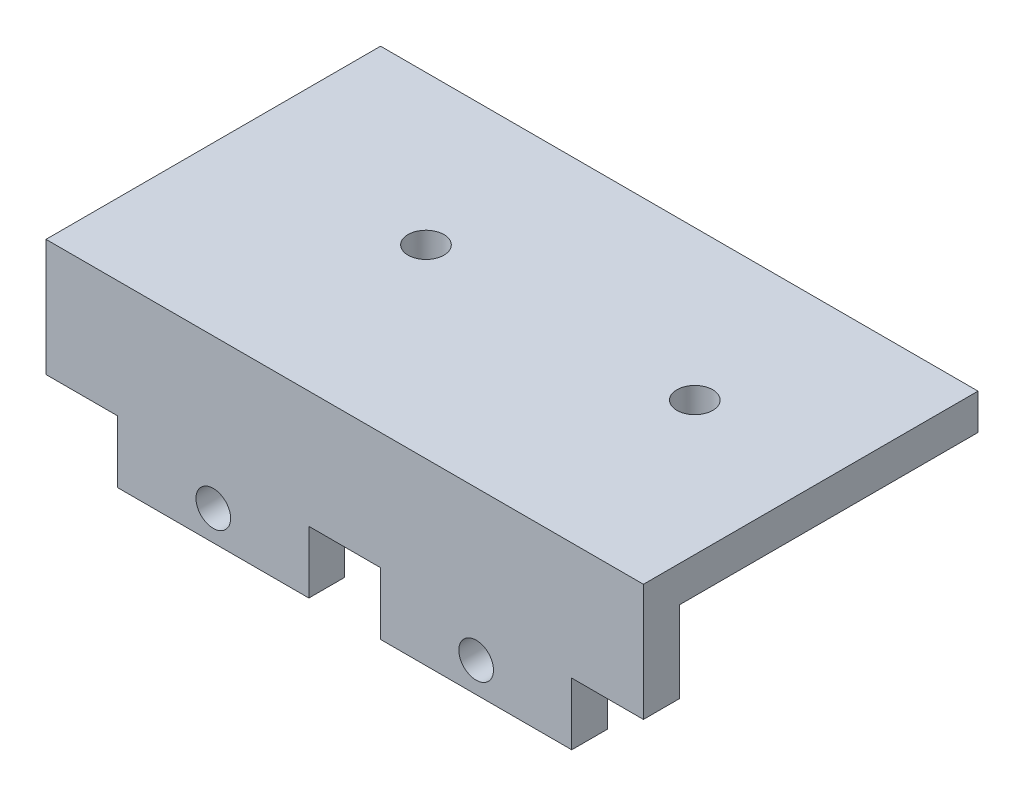
ISO-10303-21;
HEADER;
FILE_DESCRIPTION(('STEP AP214'),'2;1');
FILE_NAME('part.step','',(''),(''),'','','');
FILE_SCHEMA(('AUTOMOTIVE_DESIGN { 1 0 10303 214 1 1 1 1 }'));
ENDSEC;
DATA;
#1=APPLICATION_CONTEXT('core data for automotive mechanical design processes');
#2=APPLICATION_PROTOCOL_DEFINITION('international standard','automotive_design',2000,#1);
#3=PRODUCT_CONTEXT('',#1,'mechanical');
#4=PRODUCT('Part','Part','',(#3));
#5=PRODUCT_RELATED_PRODUCT_CATEGORY('part','',(#4));
#6=PRODUCT_DEFINITION_FORMATION('','',#4);
#7=PRODUCT_DEFINITION_CONTEXT('part definition',#1,'design');
#8=PRODUCT_DEFINITION('design','',#6,#7);
#9=PRODUCT_DEFINITION_SHAPE('','',#8);
#10=(LENGTH_UNIT() NAMED_UNIT(*) SI_UNIT(.MILLI.,.METRE.));
#11=(NAMED_UNIT(*) PLANE_ANGLE_UNIT() SI_UNIT($,.RADIAN.));
#12=(NAMED_UNIT(*) SI_UNIT($,.STERADIAN.) SOLID_ANGLE_UNIT());
#13=UNCERTAINTY_MEASURE_WITH_UNIT(LENGTH_MEASURE(1.E-05),#10,'distance_accuracy_value','');
#14=(GEOMETRIC_REPRESENTATION_CONTEXT(3) GLOBAL_UNCERTAINTY_ASSIGNED_CONTEXT((#13)) GLOBAL_UNIT_ASSIGNED_CONTEXT((#10,
#11,#12)) REPRESENTATION_CONTEXT('',''));
#15=CARTESIAN_POINT('',(0.,0.,0.));
#16=DIRECTION('',(0.,0.,1.));
#17=DIRECTION('',(1.,0.,0.));
#18=AXIS2_PLACEMENT_3D('',#15,#16,#17);
#19=CARTESIAN_POINT('',(0.,-2.5,0.));
#20=DIRECTION('',(0.,1.,0.));
#21=DIRECTION('',(0.,0.,1.));
#22=AXIS2_PLACEMENT_3D('',#19,#20,#21);
#23=PLANE('',#22);
#24=DIRECTION('',(1.,0.,0.));
#25=VECTOR('',#24,1.);
#26=CARTESIAN_POINT('',(-25.,-2.5,15.5));
#27=LINE('',#26,#25);
#28=CARTESIAN_POINT('',(-19.,-2.5,15.5));
#29=VERTEX_POINT('',#28);
#30=CARTESIAN_POINT('',(-3.,-2.5,15.5));
#31=VERTEX_POINT('',#30);
#32=EDGE_CURVE('E220',#29,#31,#27,.T.);
#33=ORIENTED_EDGE('',*,*,#32,.F.);
#34=DIRECTION('',(0.,0.,1.));
#35=VECTOR('',#34,1.);
#36=CARTESIAN_POINT('',(-19.,-2.5,-12.5));
#37=LINE('',#36,#35);
#38=CARTESIAN_POINT('',(-19.,-2.5,12.5));
#39=VERTEX_POINT('',#38);
#40=EDGE_CURVE('E245',#39,#29,#37,.T.);
#41=ORIENTED_EDGE('',*,*,#40,.F.);
#42=DIRECTION('',(-1.,0.,0.));
#43=VECTOR('',#42,1.);
#44=CARTESIAN_POINT('',(49.95,-2.5,12.5));
#45=LINE('',#44,#43);
#46=CARTESIAN_POINT('',(-3.,-2.5,12.5));
#47=VERTEX_POINT('',#46);
#48=EDGE_CURVE('E188',#47,#39,#45,.T.);
#49=ORIENTED_EDGE('',*,*,#48,.F.);
#50=DIRECTION('',(0.,0.,1.));
#51=VECTOR('',#50,1.);
#52=CARTESIAN_POINT('',(-3.,-2.5,-12.5));
#53=LINE('',#52,#51);
#54=EDGE_CURVE('E253',#47,#31,#53,.T.);
#55=ORIENTED_EDGE('',*,*,#54,.T.);
#56=EDGE_LOOP('',(#33,#41,#49,#55));
#57=FACE_BOUND('',#56,.T.);
#58=ADVANCED_FACE('F38',(#57),#23,.F.);
#59=CARTESIAN_POINT('',(0.,0.,15.5));
#60=DIRECTION('',(0.,0.,-1.));
#61=DIRECTION('',(-1.,0.,0.));
#62=AXIS2_PLACEMENT_3D('',#59,#60,#61);
#63=PLANE('',#62);
#64=CARTESIAN_POINT('',(-11.,0.,15.5));
#65=DIRECTION('',(0.,0.,-1.));
#66=DIRECTION('',(-1.,0.,0.));
#67=AXIS2_PLACEMENT_3D('',#64,#65,#66);
#68=CIRCLE('',#67,1.45);
#69=CARTESIAN_POINT('',(-12.45,0.,15.5));
#70=VERTEX_POINT('',#69);
#71=EDGE_CURVE('E168',#70,#70,#68,.T.);
#72=ORIENTED_EDGE('',*,*,#71,.T.);
#73=EDGE_LOOP('',(#72));
#74=FACE_BOUND('',#73,.T.);
#75=CARTESIAN_POINT('',(11.,0.,15.5));
#76=DIRECTION('',(0.,0.,-1.));
#77=DIRECTION('',(-1.,0.,0.));
#78=AXIS2_PLACEMENT_3D('',#75,#76,#77);
#79=CIRCLE('',#78,1.45);
#80=CARTESIAN_POINT('',(9.55,0.,15.5));
#81=VERTEX_POINT('',#80);
#82=EDGE_CURVE('E149',#81,#81,#79,.T.);
#83=ORIENTED_EDGE('',*,*,#82,.T.);
#84=EDGE_LOOP('',(#83));
#85=FACE_BOUND('',#84,.T.);
#86=DIRECTION('',(0.,-1.,0.));
#87=VECTOR('',#86,1.);
#88=CARTESIAN_POINT('',(-25.,-2.5,15.5));
#89=LINE('',#88,#87);
#90=CARTESIAN_POINT('',(-25.,12.5,15.5));
#91=VERTEX_POINT('',#90);
#92=CARTESIAN_POINT('',(-25.,2.7,15.5));
#93=VERTEX_POINT('',#92);
#94=EDGE_CURVE('E216',#91,#93,#89,.T.);
#95=ORIENTED_EDGE('',*,*,#94,.T.);
#96=DIRECTION('',(1.,0.,0.));
#97=VECTOR('',#96,1.);
#98=CARTESIAN_POINT('',(0.,2.7,15.5));
#99=LINE('',#98,#97);
#100=CARTESIAN_POINT('',(-19.,2.7,15.5));
#101=VERTEX_POINT('',#100);
#102=EDGE_CURVE('E185',#93,#101,#99,.T.);
#103=ORIENTED_EDGE('',*,*,#102,.T.);
#104=DIRECTION('',(0.,-1.,0.));
#105=VECTOR('',#104,1.);
#106=CARTESIAN_POINT('',(-19.,0.,15.5));
#107=LINE('',#106,#105);
#108=EDGE_CURVE('E182',#101,#29,#107,.T.);
#109=ORIENTED_EDGE('',*,*,#108,.T.);
#110=ORIENTED_EDGE('',*,*,#32,.T.);
#111=DIRECTION('',(0.,1.,0.));
#112=VECTOR('',#111,1.);
#113=CARTESIAN_POINT('',(-3.,0.,15.5));
#114=LINE('',#113,#112);
#115=CARTESIAN_POINT('',(-3.,2.7,15.5));
#116=VERTEX_POINT('',#115);
#117=EDGE_CURVE('E179',#31,#116,#114,.T.);
#118=ORIENTED_EDGE('',*,*,#117,.T.);
#119=DIRECTION('',(1.,0.,0.));
#120=VECTOR('',#119,1.);
#121=CARTESIAN_POINT('',(0.,2.7,15.5));
#122=LINE('',#121,#120);
#123=CARTESIAN_POINT('',(3.,2.7,15.5));
#124=VERTEX_POINT('',#123);
#125=EDGE_CURVE('E176',#116,#124,#122,.T.);
#126=ORIENTED_EDGE('',*,*,#125,.T.);
#127=DIRECTION('',(0.,-1.,0.));
#128=VECTOR('',#127,1.);
#129=CARTESIAN_POINT('',(3.,0.,15.5));
#130=LINE('',#129,#128);
#131=CARTESIAN_POINT('',(3.,-2.5,15.5));
#132=VERTEX_POINT('',#131);
#133=EDGE_CURVE('E174',#124,#132,#130,.T.);
#134=ORIENTED_EDGE('',*,*,#133,.T.);
#135=CARTESIAN_POINT('',(19.,-2.5,15.5));
#136=VERTEX_POINT('',#135);
#137=EDGE_CURVE('E164',#132,#136,#27,.T.);
#138=ORIENTED_EDGE('',*,*,#137,.T.);
#139=DIRECTION('',(0.,1.,0.));
#140=VECTOR('',#139,1.);
#141=CARTESIAN_POINT('',(19.,0.,15.5));
#142=LINE('',#141,#140);
#143=CARTESIAN_POINT('',(19.,2.7,15.5));
#144=VERTEX_POINT('',#143);
#145=EDGE_CURVE('E148',#136,#144,#142,.T.);
#146=ORIENTED_EDGE('',*,*,#145,.T.);
#147=DIRECTION('',(1.,0.,0.));
#148=VECTOR('',#147,1.);
#149=CARTESIAN_POINT('',(0.,2.7,15.5));
#150=LINE('',#149,#148);
#151=CARTESIAN_POINT('',(25.,2.7,15.5));
#152=VERTEX_POINT('',#151);
#153=EDGE_CURVE('E138',#144,#152,#150,.T.);
#154=ORIENTED_EDGE('',*,*,#153,.T.);
#155=DIRECTION('',(0.,1.,0.));
#156=VECTOR('',#155,1.);
#157=CARTESIAN_POINT('',(25.,-2.5,15.5));
#158=LINE('',#157,#156);
#159=CARTESIAN_POINT('',(25.,12.5,15.5));
#160=VERTEX_POINT('',#159);
#161=EDGE_CURVE('E221',#152,#160,#158,.T.);
#162=ORIENTED_EDGE('',*,*,#161,.T.);
#163=DIRECTION('',(1.,0.,0.));
#164=VECTOR('',#163,1.);
#165=CARTESIAN_POINT('',(-25.,12.5,15.5));
#166=LINE('',#165,#164);
#167=EDGE_CURVE('E195',#91,#160,#166,.T.);
#168=ORIENTED_EDGE('',*,*,#167,.F.);
#169=EDGE_LOOP('',(#95,#103,#109,#110,#118,#126,#134,#138,#146,#154,#162,#168));
#170=FACE_BOUND('',#169,.T.);
#171=ADVANCED_FACE('F161',(#74,#85,#170),#63,.F.);
#172=CARTESIAN_POINT('',(25.,2.5,0.));
#173=DIRECTION('',(-1.,0.,0.));
#174=DIRECTION('',(0.,0.,1.));
#175=AXIS2_PLACEMENT_3D('',#172,#173,#174);
#176=PLANE('',#175);
#177=ORIENTED_EDGE('',*,*,#161,.F.);
#178=DIRECTION('',(0.,0.,1.));
#179=VECTOR('',#178,1.);
#180=CARTESIAN_POINT('',(25.,2.7,-12.5));
#181=LINE('',#180,#179);
#182=CARTESIAN_POINT('',(25.,2.7,12.5));
#183=VERTEX_POINT('',#182);
#184=EDGE_CURVE('E144',#183,#152,#181,.T.);
#185=ORIENTED_EDGE('',*,*,#184,.F.);
#186=DIRECTION('',(0.,1.,0.));
#187=VECTOR('',#186,1.);
#188=CARTESIAN_POINT('',(25.,-2.5,12.5));
#189=LINE('',#188,#187);
#190=CARTESIAN_POINT('',(25.,9.5,12.5));
#191=VERTEX_POINT('',#190);
#192=EDGE_CURVE('E226',#183,#191,#189,.T.);
#193=ORIENTED_EDGE('',*,*,#192,.T.);
#194=DIRECTION('',(0.,0.,-1.));
#195=VECTOR('',#194,1.);
#196=CARTESIAN_POINT('',(25.,9.5,15.5));
#197=LINE('',#196,#195);
#198=CARTESIAN_POINT('',(25.,9.5,-12.5));
#199=VERTEX_POINT('',#198);
#200=EDGE_CURVE('E207',#191,#199,#197,.T.);
#201=ORIENTED_EDGE('',*,*,#200,.T.);
#202=DIRECTION('',(0.,-1.,0.));
#203=VECTOR('',#202,1.);
#204=CARTESIAN_POINT('',(25.,12.5,-12.5));
#205=LINE('',#204,#203);
#206=CARTESIAN_POINT('',(25.,12.5,-12.5));
#207=VERTEX_POINT('',#206);
#208=EDGE_CURVE('E212',#207,#199,#205,.T.);
#209=ORIENTED_EDGE('',*,*,#208,.F.);
#210=DIRECTION('',(0.,0.,-1.));
#211=VECTOR('',#210,1.);
#212=CARTESIAN_POINT('',(25.,12.5,15.5));
#213=LINE('',#212,#211);
#214=EDGE_CURVE('E199',#160,#207,#213,.T.);
#215=ORIENTED_EDGE('',*,*,#214,.F.);
#216=EDGE_LOOP('',(#177,#185,#193,#201,#209,#215));
#217=FACE_BOUND('',#216,.T.);
#218=ADVANCED_FACE('F40',(#217),#176,.F.);
#219=ORIENTED_EDGE('',*,*,#137,.F.);
#220=DIRECTION('',(0.,0.,1.));
#221=VECTOR('',#220,1.);
#222=CARTESIAN_POINT('',(3.,-2.5,-12.5));
#223=LINE('',#222,#221);
#224=CARTESIAN_POINT('',(3.,-2.5,12.5));
#225=VERTEX_POINT('',#224);
#226=EDGE_CURVE('E268',#225,#132,#223,.T.);
#227=ORIENTED_EDGE('',*,*,#226,.F.);
#228=CARTESIAN_POINT('',(19.,-2.5,12.5));
#229=VERTEX_POINT('',#228);
#230=EDGE_CURVE('E191',#229,#225,#45,.T.);
#231=ORIENTED_EDGE('',*,*,#230,.F.);
#232=DIRECTION('',(0.,0.,1.));
#233=VECTOR('',#232,1.);
#234=CARTESIAN_POINT('',(19.,-2.5,-12.5));
#235=LINE('',#234,#233);
#236=EDGE_CURVE('E157',#229,#136,#235,.T.);
#237=ORIENTED_EDGE('',*,*,#236,.T.);
#238=EDGE_LOOP('',(#219,#227,#231,#237));
#239=FACE_BOUND('',#238,.T.);
#240=ADVANCED_FACE('F294',(#239),#23,.F.);
#241=CARTESIAN_POINT('',(-25.,2.5,0.));
#242=DIRECTION('',(-1.,0.,0.));
#243=DIRECTION('',(0.,0.,1.));
#244=AXIS2_PLACEMENT_3D('',#241,#242,#243);
#245=PLANE('',#244);
#246=DIRECTION('',(0.,0.,1.));
#247=VECTOR('',#246,1.);
#248=CARTESIAN_POINT('',(-25.,2.7,-12.5));
#249=LINE('',#248,#247);
#250=CARTESIAN_POINT('',(-25.,2.7,12.5));
#251=VERTEX_POINT('',#250);
#252=EDGE_CURVE('E233',#251,#93,#249,.T.);
#253=ORIENTED_EDGE('',*,*,#252,.T.);
#254=ORIENTED_EDGE('',*,*,#94,.F.);
#255=DIRECTION('',(0.,0.,1.));
#256=VECTOR('',#255,1.);
#257=CARTESIAN_POINT('',(-25.,12.5,15.5));
#258=LINE('',#257,#256);
#259=CARTESIAN_POINT('',(-25.,12.5,-12.5));
#260=VERTEX_POINT('',#259);
#261=EDGE_CURVE('E192',#260,#91,#258,.T.);
#262=ORIENTED_EDGE('',*,*,#261,.F.);
#263=DIRECTION('',(0.,-1.,0.));
#264=VECTOR('',#263,1.);
#265=CARTESIAN_POINT('',(-25.,12.5,-12.5));
#266=LINE('',#265,#264);
#267=CARTESIAN_POINT('',(-25.,9.5,-12.5));
#268=VERTEX_POINT('',#267);
#269=EDGE_CURVE('E203',#260,#268,#266,.T.);
#270=ORIENTED_EDGE('',*,*,#269,.T.);
#271=DIRECTION('',(0.,0.,1.));
#272=VECTOR('',#271,1.);
#273=CARTESIAN_POINT('',(-25.,9.5,15.5));
#274=LINE('',#273,#272);
#275=CARTESIAN_POINT('',(-25.,9.5,12.5));
#276=VERTEX_POINT('',#275);
#277=EDGE_CURVE('E204',#268,#276,#274,.T.);
#278=ORIENTED_EDGE('',*,*,#277,.T.);
#279=DIRECTION('',(0.,-1.,0.));
#280=VECTOR('',#279,1.);
#281=CARTESIAN_POINT('',(-25.,-2.5,12.5));
#282=LINE('',#281,#280);
#283=EDGE_CURVE('E215',#276,#251,#282,.T.);
#284=ORIENTED_EDGE('',*,*,#283,.T.);
#285=EDGE_LOOP('',(#253,#254,#262,#270,#278,#284));
#286=FACE_BOUND('',#285,.T.);
#287=ADVANCED_FACE('F302',(#286),#245,.T.);
#288=CARTESIAN_POINT('',(0.,0.,12.5));
#289=DIRECTION('',(0.,0.,-1.));
#290=DIRECTION('',(-1.,0.,0.));
#291=AXIS2_PLACEMENT_3D('',#288,#289,#290);
#292=PLANE('',#291);
#293=DIRECTION('',(1.,0.,0.));
#294=VECTOR('',#293,1.);
#295=CARTESIAN_POINT('',(0.,2.7,12.5));
#296=LINE('',#295,#294);
#297=CARTESIAN_POINT('',(-19.,2.7,12.5));
#298=VERTEX_POINT('',#297);
#299=EDGE_CURVE('E11',#251,#298,#296,.T.);
#300=ORIENTED_EDGE('',*,*,#299,.F.);
#301=ORIENTED_EDGE('',*,*,#283,.F.);
#302=DIRECTION('',(-1.,0.,0.));
#303=VECTOR('',#302,1.);
#304=CARTESIAN_POINT('',(-25.,9.5,12.5));
#305=LINE('',#304,#303);
#306=EDGE_CURVE('E218',#191,#276,#305,.T.);
#307=ORIENTED_EDGE('',*,*,#306,.F.);
#308=ORIENTED_EDGE('',*,*,#192,.F.);
#309=DIRECTION('',(1.,0.,0.));
#310=VECTOR('',#309,1.);
#311=CARTESIAN_POINT('',(0.,2.7,12.5));
#312=LINE('',#311,#310);
#313=CARTESIAN_POINT('',(19.,2.7,12.5));
#314=VERTEX_POINT('',#313);
#315=EDGE_CURVE('E223',#314,#183,#312,.T.);
#316=ORIENTED_EDGE('',*,*,#315,.F.);
#317=DIRECTION('',(0.,1.,0.));
#318=VECTOR('',#317,1.);
#319=CARTESIAN_POINT('',(19.,0.,12.5));
#320=LINE('',#319,#318);
#321=EDGE_CURVE('E155',#229,#314,#320,.T.);
#322=ORIENTED_EDGE('',*,*,#321,.F.);
#323=ORIENTED_EDGE('',*,*,#230,.T.);
#324=DIRECTION('',(0.,-1.,0.));
#325=VECTOR('',#324,1.);
#326=CARTESIAN_POINT('',(3.,0.,12.5));
#327=LINE('',#326,#325);
#328=CARTESIAN_POINT('',(3.,2.7,12.5));
#329=VERTEX_POINT('',#328);
#330=EDGE_CURVE('E235',#329,#225,#327,.T.);
#331=ORIENTED_EDGE('',*,*,#330,.F.);
#332=DIRECTION('',(1.,0.,0.));
#333=VECTOR('',#332,1.);
#334=CARTESIAN_POINT('',(0.,2.7,12.5));
#335=LINE('',#334,#333);
#336=CARTESIAN_POINT('',(-3.,2.7,12.5));
#337=VERTEX_POINT('',#336);
#338=EDGE_CURVE('E238',#337,#329,#335,.T.);
#339=ORIENTED_EDGE('',*,*,#338,.F.);
#340=DIRECTION('',(0.,1.,0.));
#341=VECTOR('',#340,1.);
#342=CARTESIAN_POINT('',(-3.,0.,12.5));
#343=LINE('',#342,#341);
#344=EDGE_CURVE('E240',#47,#337,#343,.T.);
#345=ORIENTED_EDGE('',*,*,#344,.F.);
#346=ORIENTED_EDGE('',*,*,#48,.T.);
#347=DIRECTION('',(0.,-1.,0.));
#348=VECTOR('',#347,1.);
#349=CARTESIAN_POINT('',(-19.,0.,12.5));
#350=LINE('',#349,#348);
#351=EDGE_CURVE('E47',#298,#39,#350,.T.);
#352=ORIENTED_EDGE('',*,*,#351,.F.);
#353=EDGE_LOOP('',(#300,#301,#307,#308,#316,#322,#323,#331,#339,#345,#346,#352));
#354=FACE_BOUND('',#353,.T.);
#355=CARTESIAN_POINT('',(-11.,0.,12.5));
#356=DIRECTION('',(0.,0.,-1.));
#357=DIRECTION('',(-1.,0.,0.));
#358=AXIS2_PLACEMENT_3D('',#355,#356,#357);
#359=CIRCLE('',#358,1.45);
#360=CARTESIAN_POINT('',(-12.45,0.,12.5));
#361=VERTEX_POINT('',#360);
#362=EDGE_CURVE('E165',#361,#361,#359,.T.);
#363=ORIENTED_EDGE('',*,*,#362,.F.);
#364=EDGE_LOOP('',(#363));
#365=FACE_BOUND('',#364,.T.);
#366=CARTESIAN_POINT('',(11.,0.,12.5));
#367=DIRECTION('',(0.,0.,-1.));
#368=DIRECTION('',(-1.,0.,0.));
#369=AXIS2_PLACEMENT_3D('',#366,#367,#368);
#370=CIRCLE('',#369,1.45);
#371=CARTESIAN_POINT('',(9.55,0.,12.5));
#372=VERTEX_POINT('',#371);
#373=EDGE_CURVE('E230',#372,#372,#370,.T.);
#374=ORIENTED_EDGE('',*,*,#373,.F.);
#375=EDGE_LOOP('',(#374));
#376=FACE_BOUND('',#375,.T.);
#377=ADVANCED_FACE('F256',(#354,#365,#376),#292,.T.);
#378=CARTESIAN_POINT('',(-25.,12.5,-12.5));
#379=DIRECTION('',(0.,0.,1.));
#380=DIRECTION('',(1.,0.,0.));
#381=AXIS2_PLACEMENT_3D('',#378,#379,#380);
#382=PLANE('',#381);
#383=DIRECTION('',(-1.,0.,0.));
#384=VECTOR('',#383,1.);
#385=CARTESIAN_POINT('',(-25.,9.5,-12.5));
#386=LINE('',#385,#384);
#387=EDGE_CURVE('E196',#199,#268,#386,.T.);
#388=ORIENTED_EDGE('',*,*,#387,.T.);
#389=ORIENTED_EDGE('',*,*,#269,.F.);
#390=DIRECTION('',(-1.,0.,0.));
#391=VECTOR('',#390,1.);
#392=CARTESIAN_POINT('',(-25.,12.5,-12.5));
#393=LINE('',#392,#391);
#394=EDGE_CURVE('E201',#207,#260,#393,.T.);
#395=ORIENTED_EDGE('',*,*,#394,.F.);
#396=ORIENTED_EDGE('',*,*,#208,.T.);
#397=EDGE_LOOP('',(#388,#389,#395,#396));
#398=FACE_BOUND('',#397,.T.);
#399=ADVANCED_FACE('F409',(#398),#382,.F.);
#400=CARTESIAN_POINT('',(0.,12.5,0.));
#401=DIRECTION('',(0.,-1.,0.));
#402=DIRECTION('',(0.,0.,-1.));
#403=AXIS2_PLACEMENT_3D('',#400,#401,#402);
#404=PLANE('',#403);
#405=CARTESIAN_POINT('',(13.8,12.5,0.));
#406=DIRECTION('',(0.,-1.,0.));
#407=DIRECTION('',(0.,0.,-1.));
#408=AXIS2_PLACEMENT_3D('',#405,#406,#407);
#409=CIRCLE('',#408,1.5);
#410=CARTESIAN_POINT('',(13.8,12.5,-1.5));
#411=VERTEX_POINT('',#410);
#412=EDGE_CURVE('E587',#411,#411,#409,.T.);
#413=ORIENTED_EDGE('',*,*,#412,.T.);
#414=EDGE_LOOP('',(#413));
#415=FACE_BOUND('',#414,.T.);
#416=CARTESIAN_POINT('',(-8.70000000000001,12.5,0.));
#417=DIRECTION('',(0.,-1.,0.));
#418=DIRECTION('',(0.,0.,-1.));
#419=AXIS2_PLACEMENT_3D('',#416,#417,#418);
#420=CIRCLE('',#419,1.5);
#421=CARTESIAN_POINT('',(-8.70000000000001,12.5,-1.5));
#422=VERTEX_POINT('',#421);
#423=EDGE_CURVE('E273',#422,#422,#420,.T.);
#424=ORIENTED_EDGE('',*,*,#423,.T.);
#425=EDGE_LOOP('',(#424));
#426=FACE_BOUND('',#425,.T.);
#427=ORIENTED_EDGE('',*,*,#261,.T.);
#428=ORIENTED_EDGE('',*,*,#167,.T.);
#429=ORIENTED_EDGE('',*,*,#214,.T.);
#430=ORIENTED_EDGE('',*,*,#394,.T.);
#431=EDGE_LOOP('',(#427,#428,#429,#430));
#432=FACE_BOUND('',#431,.T.);
#433=ADVANCED_FACE('F288',(#415,#426,#432),#404,.F.);
#434=CARTESIAN_POINT('',(0.,9.5,0.));
#435=DIRECTION('',(0.,-1.,0.));
#436=DIRECTION('',(0.,0.,-1.));
#437=AXIS2_PLACEMENT_3D('',#434,#435,#436);
#438=PLANE('',#437);
#439=CARTESIAN_POINT('',(13.8,9.5,0.));
#440=DIRECTION('',(0.,-1.,0.));
#441=DIRECTION('',(0.,0.,-1.));
#442=AXIS2_PLACEMENT_3D('',#439,#440,#441);
#443=CIRCLE('',#442,1.5);
#444=CARTESIAN_POINT('',(13.8,9.5,-1.5));
#445=VERTEX_POINT('',#444);
#446=EDGE_CURVE('E42',#445,#445,#443,.T.);
#447=ORIENTED_EDGE('',*,*,#446,.F.);
#448=EDGE_LOOP('',(#447));
#449=FACE_BOUND('',#448,.T.);
#450=CARTESIAN_POINT('',(-8.70000000000001,9.5,0.));
#451=DIRECTION('',(0.,-1.,0.));
#452=DIRECTION('',(0.,0.,-1.));
#453=AXIS2_PLACEMENT_3D('',#450,#451,#452);
#454=CIRCLE('',#453,1.5);
#455=CARTESIAN_POINT('',(-8.70000000000001,9.5,-1.5));
#456=VERTEX_POINT('',#455);
#457=EDGE_CURVE('E588',#456,#456,#454,.T.);
#458=ORIENTED_EDGE('',*,*,#457,.F.);
#459=EDGE_LOOP('',(#458));
#460=FACE_BOUND('',#459,.T.);
#461=ORIENTED_EDGE('',*,*,#200,.F.);
#462=ORIENTED_EDGE('',*,*,#306,.T.);
#463=ORIENTED_EDGE('',*,*,#277,.F.);
#464=ORIENTED_EDGE('',*,*,#387,.F.);
#465=EDGE_LOOP('',(#461,#462,#463,#464));
#466=FACE_BOUND('',#465,.T.);
#467=ADVANCED_FACE('F280',(#449,#460,#466),#438,.T.);
#468=CARTESIAN_POINT('',(11.,0.,-12.5));
#469=DIRECTION('',(0.,0.,1.));
#470=DIRECTION('',(1.,0.,0.));
#471=AXIS2_PLACEMENT_3D('',#468,#469,#470);
#472=CYLINDRICAL_SURFACE('',#471,1.45);
#473=ORIENTED_EDGE('',*,*,#373,.T.);
#474=EDGE_LOOP('',(#473));
#475=FACE_BOUND('',#474,.T.);
#476=ORIENTED_EDGE('',*,*,#82,.F.);
#477=EDGE_LOOP('',(#476));
#478=FACE_BOUND('',#477,.T.);
#479=ADVANCED_FACE('F278',(#475,#478),#472,.F.);
#480=CARTESIAN_POINT('',(19.,-2.5,-12.5));
#481=DIRECTION('',(-1.,0.,0.));
#482=DIRECTION('',(0.,0.,1.));
#483=AXIS2_PLACEMENT_3D('',#480,#481,#482);
#484=PLANE('',#483);
#485=ORIENTED_EDGE('',*,*,#236,.F.);
#486=ORIENTED_EDGE('',*,*,#321,.T.);
#487=DIRECTION('',(0.,0.,1.));
#488=VECTOR('',#487,1.);
#489=CARTESIAN_POINT('',(19.,2.7,-12.5));
#490=LINE('',#489,#488);
#491=EDGE_CURVE('E141',#314,#144,#490,.T.);
#492=ORIENTED_EDGE('',*,*,#491,.T.);
#493=ORIENTED_EDGE('',*,*,#145,.F.);
#494=EDGE_LOOP('',(#485,#486,#492,#493));
#495=FACE_BOUND('',#494,.T.);
#496=ADVANCED_FACE('F152',(#495),#484,.F.);
#497=CARTESIAN_POINT('',(25.,2.7,-12.5));
#498=DIRECTION('',(0.,1.,0.));
#499=DIRECTION('',(-1.,0.,0.));
#500=AXIS2_PLACEMENT_3D('',#497,#498,#499);
#501=PLANE('',#500);
#502=ORIENTED_EDGE('',*,*,#491,.F.);
#503=ORIENTED_EDGE('',*,*,#315,.T.);
#504=ORIENTED_EDGE('',*,*,#184,.T.);
#505=ORIENTED_EDGE('',*,*,#153,.F.);
#506=EDGE_LOOP('',(#502,#503,#504,#505));
#507=FACE_BOUND('',#506,.T.);
#508=ADVANCED_FACE('F140',(#507),#501,.F.);
#509=CARTESIAN_POINT('',(-11.,0.,-12.5));
#510=DIRECTION('',(0.,0.,1.));
#511=DIRECTION('',(1.,0.,0.));
#512=AXIS2_PLACEMENT_3D('',#509,#510,#511);
#513=CYLINDRICAL_SURFACE('',#512,1.45);
#514=ORIENTED_EDGE('',*,*,#362,.T.);
#515=EDGE_LOOP('',(#514));
#516=FACE_BOUND('',#515,.T.);
#517=ORIENTED_EDGE('',*,*,#71,.F.);
#518=EDGE_LOOP('',(#517));
#519=FACE_BOUND('',#518,.T.);
#520=ADVANCED_FACE('F342',(#516,#519),#513,.F.);
#521=CARTESIAN_POINT('',(-3.,-2.5,-12.5));
#522=DIRECTION('',(-1.,0.,0.));
#523=DIRECTION('',(0.,-1.,0.));
#524=AXIS2_PLACEMENT_3D('',#521,#522,#523);
#525=PLANE('',#524);
#526=ORIENTED_EDGE('',*,*,#54,.F.);
#527=ORIENTED_EDGE('',*,*,#344,.T.);
#528=DIRECTION('',(0.,0.,1.));
#529=VECTOR('',#528,1.);
#530=CARTESIAN_POINT('',(-3.,2.7,-12.5));
#531=LINE('',#530,#529);
#532=EDGE_CURVE('E264',#337,#116,#531,.T.);
#533=ORIENTED_EDGE('',*,*,#532,.T.);
#534=ORIENTED_EDGE('',*,*,#117,.F.);
#535=EDGE_LOOP('',(#526,#527,#533,#534));
#536=FACE_BOUND('',#535,.T.);
#537=ADVANCED_FACE('F263',(#536),#525,.F.);
#538=CARTESIAN_POINT('',(-3.,2.7,-12.5));
#539=DIRECTION('',(0.,1.,0.));
#540=DIRECTION('',(0.,0.,1.));
#541=AXIS2_PLACEMENT_3D('',#538,#539,#540);
#542=PLANE('',#541);
#543=ORIENTED_EDGE('',*,*,#532,.F.);
#544=ORIENTED_EDGE('',*,*,#338,.T.);
#545=DIRECTION('',(0.,0.,1.));
#546=VECTOR('',#545,1.);
#547=CARTESIAN_POINT('',(3.,2.7,-12.5));
#548=LINE('',#547,#546);
#549=EDGE_CURVE('E61',#329,#124,#548,.T.);
#550=ORIENTED_EDGE('',*,*,#549,.T.);
#551=ORIENTED_EDGE('',*,*,#125,.F.);
#552=EDGE_LOOP('',(#543,#544,#550,#551));
#553=FACE_BOUND('',#552,.T.);
#554=ADVANCED_FACE('F266',(#553),#542,.F.);
#555=CARTESIAN_POINT('',(3.,-2.5,-12.5));
#556=DIRECTION('',(1.,0.,0.));
#557=DIRECTION('',(0.,0.,-1.));
#558=AXIS2_PLACEMENT_3D('',#555,#556,#557);
#559=PLANE('',#558);
#560=ORIENTED_EDGE('',*,*,#549,.F.);
#561=ORIENTED_EDGE('',*,*,#330,.T.);
#562=ORIENTED_EDGE('',*,*,#226,.T.);
#563=ORIENTED_EDGE('',*,*,#133,.F.);
#564=EDGE_LOOP('',(#560,#561,#562,#563));
#565=FACE_BOUND('',#564,.T.);
#566=ADVANCED_FACE('F330',(#565),#559,.F.);
#567=CARTESIAN_POINT('',(-25.,2.7,-12.5));
#568=DIRECTION('',(0.,1.,0.));
#569=DIRECTION('',(0.,0.,1.));
#570=AXIS2_PLACEMENT_3D('',#567,#568,#569);
#571=PLANE('',#570);
#572=ORIENTED_EDGE('',*,*,#252,.F.);
#573=ORIENTED_EDGE('',*,*,#299,.T.);
#574=DIRECTION('',(0.,0.,1.));
#575=VECTOR('',#574,1.);
#576=CARTESIAN_POINT('',(-19.,2.7,-12.5));
#577=LINE('',#576,#575);
#578=EDGE_CURVE('E54',#298,#101,#577,.T.);
#579=ORIENTED_EDGE('',*,*,#578,.T.);
#580=ORIENTED_EDGE('',*,*,#102,.F.);
#581=EDGE_LOOP('',(#572,#573,#579,#580));
#582=FACE_BOUND('',#581,.T.);
#583=ADVANCED_FACE('F325',(#582),#571,.F.);
#584=CARTESIAN_POINT('',(-19.,-2.5,-12.5));
#585=DIRECTION('',(1.,0.,0.));
#586=DIRECTION('',(0.,0.,-1.));
#587=AXIS2_PLACEMENT_3D('',#584,#585,#586);
#588=PLANE('',#587);
#589=ORIENTED_EDGE('',*,*,#578,.F.);
#590=ORIENTED_EDGE('',*,*,#351,.T.);
#591=ORIENTED_EDGE('',*,*,#40,.T.);
#592=ORIENTED_EDGE('',*,*,#108,.F.);
#593=EDGE_LOOP('',(#589,#590,#591,#592));
#594=FACE_BOUND('',#593,.T.);
#595=ADVANCED_FACE('F244',(#594),#588,.F.);
#596=CARTESIAN_POINT('',(-8.70000000000001,-2.5,0.));
#597=DIRECTION('',(0.,1.,0.));
#598=DIRECTION('',(0.,0.,1.));
#599=AXIS2_PLACEMENT_3D('',#596,#597,#598);
#600=CYLINDRICAL_SURFACE('',#599,1.5);
#601=ORIENTED_EDGE('',*,*,#457,.T.);
#602=EDGE_LOOP('',(#601));
#603=FACE_BOUND('',#602,.T.);
#604=ORIENTED_EDGE('',*,*,#423,.F.);
#605=EDGE_LOOP('',(#604));
#606=FACE_BOUND('',#605,.T.);
#607=ADVANCED_FACE('F386',(#603,#606),#600,.F.);
#608=CARTESIAN_POINT('',(13.8,-2.5,0.));
#609=DIRECTION('',(0.,1.,0.));
#610=DIRECTION('',(0.,0.,1.));
#611=AXIS2_PLACEMENT_3D('',#608,#609,#610);
#612=CYLINDRICAL_SURFACE('',#611,1.5);
#613=ORIENTED_EDGE('',*,*,#446,.T.);
#614=EDGE_LOOP('',(#613));
#615=FACE_BOUND('',#614,.T.);
#616=ORIENTED_EDGE('',*,*,#412,.F.);
#617=EDGE_LOOP('',(#616));
#618=FACE_BOUND('',#617,.T.);
#619=ADVANCED_FACE('F396',(#615,#618),#612,.F.);
#620=CLOSED_SHELL('',(#58,#171,#218,#240,#287,#377,#399,#433,#467,#479,#496,#508,#520,#537,#554,
#566,#583,#595,#607,#619));
#621=MANIFOLD_SOLID_BREP('B2',#620);
#622=ADVANCED_BREP_SHAPE_REPRESENTATION('',(#18,#621),#14);
#623=SHAPE_DEFINITION_REPRESENTATION(#9,#622);
ENDSEC;
END-ISO-10303-21;
